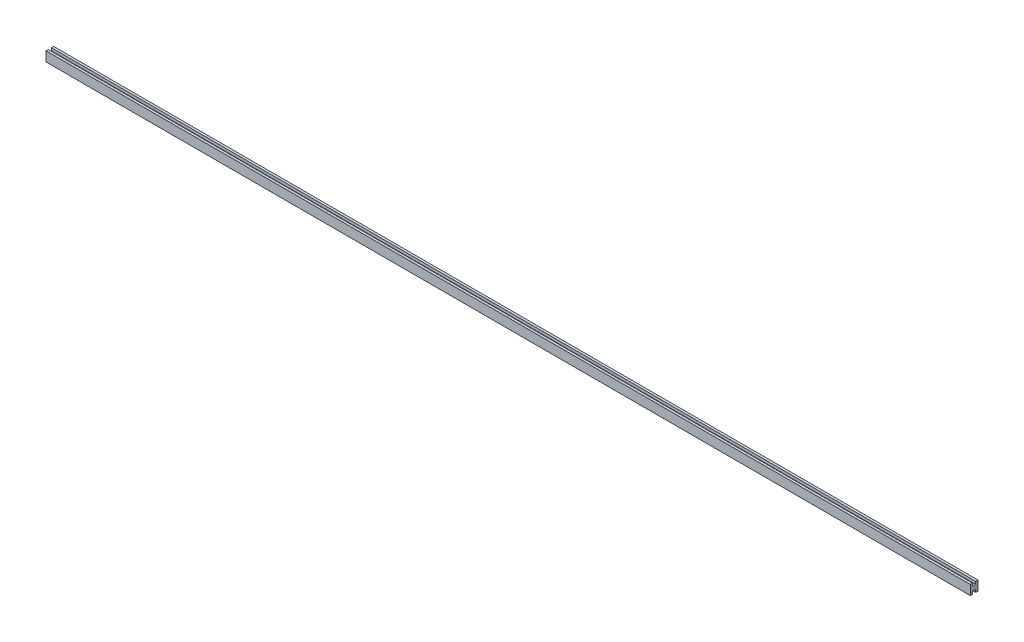
ISO-10303-21;
HEADER;
FILE_DESCRIPTION(('STEP AP214'),'2;1');
FILE_NAME('part.step','',(''),(''),'','','');
FILE_SCHEMA(('AUTOMOTIVE_DESIGN { 1 0 10303 214 1 1 1 1 }'));
ENDSEC;
DATA;
#1=APPLICATION_CONTEXT('core data for automotive mechanical design processes');
#2=APPLICATION_PROTOCOL_DEFINITION('international standard','automotive_design',2000,#1);
#3=PRODUCT_CONTEXT('',#1,'mechanical');
#4=PRODUCT('Part','Part','',(#3));
#5=PRODUCT_RELATED_PRODUCT_CATEGORY('part','',(#4));
#6=PRODUCT_DEFINITION_FORMATION('','',#4);
#7=PRODUCT_DEFINITION_CONTEXT('part definition',#1,'design');
#8=PRODUCT_DEFINITION('design','',#6,#7);
#9=PRODUCT_DEFINITION_SHAPE('','',#8);
#10=(LENGTH_UNIT() NAMED_UNIT(*) SI_UNIT(.MILLI.,.METRE.));
#11=(NAMED_UNIT(*) PLANE_ANGLE_UNIT() SI_UNIT($,.RADIAN.));
#12=(NAMED_UNIT(*) SI_UNIT($,.STERADIAN.) SOLID_ANGLE_UNIT());
#13=UNCERTAINTY_MEASURE_WITH_UNIT(LENGTH_MEASURE(1.E-05),#10,'distance_accuracy_value','');
#14=(GEOMETRIC_REPRESENTATION_CONTEXT(3) GLOBAL_UNCERTAINTY_ASSIGNED_CONTEXT((#13)) GLOBAL_UNIT_ASSIGNED_CONTEXT((#10,
#11,#12)) REPRESENTATION_CONTEXT('',''));
#15=CARTESIAN_POINT('',(0.,0.,0.));
#16=DIRECTION('',(0.,0.,1.));
#17=DIRECTION('',(1.,0.,0.));
#18=AXIS2_PLACEMENT_3D('',#15,#16,#17);
#19=CARTESIAN_POINT('',(3048.,15.875,12.7));
#20=DIRECTION('',(0.,1.,0.));
#21=DIRECTION('',(0.,0.,1.));
#22=AXIS2_PLACEMENT_3D('',#19,#20,#21);
#23=PLANE('',#22);
#24=DIRECTION('',(0.,0.,-1.));
#25=VECTOR('',#24,1.);
#26=CARTESIAN_POINT('',(0.,15.875,12.7));
#27=LINE('',#26,#25);
#28=CARTESIAN_POINT('',(0.,15.875,12.7));
#29=VERTEX_POINT('',#28);
#30=CARTESIAN_POINT('',(0.,15.875,5.08));
#31=VERTEX_POINT('',#30);
#32=EDGE_CURVE('E165',#29,#31,#27,.T.);
#33=ORIENTED_EDGE('',*,*,#32,.F.);
#34=DIRECTION('',(-1.,0.,0.));
#35=VECTOR('',#34,1.);
#36=CARTESIAN_POINT('',(3048.,15.875,12.7));
#37=LINE('',#36,#35);
#38=CARTESIAN_POINT('',(3048.,15.875,12.7));
#39=VERTEX_POINT('',#38);
#40=EDGE_CURVE('E11',#39,#29,#37,.T.);
#41=ORIENTED_EDGE('',*,*,#40,.F.);
#42=DIRECTION('',(0.,0.,-1.));
#43=VECTOR('',#42,1.);
#44=CARTESIAN_POINT('',(3048.,15.875,12.7));
#45=LINE('',#44,#43);
#46=CARTESIAN_POINT('',(3048.,15.875,5.08));
#47=VERTEX_POINT('',#46);
#48=EDGE_CURVE('E206',#39,#47,#45,.T.);
#49=ORIENTED_EDGE('',*,*,#48,.T.);
#50=DIRECTION('',(-1.,0.,0.));
#51=VECTOR('',#50,1.);
#52=CARTESIAN_POINT('',(3048.,15.875,5.08));
#53=LINE('',#52,#51);
#54=EDGE_CURVE('E42',#47,#31,#53,.T.);
#55=ORIENTED_EDGE('',*,*,#54,.T.);
#56=EDGE_LOOP('',(#33,#41,#49,#55));
#57=FACE_BOUND('',#56,.T.);
#58=ADVANCED_FACE('F39',(#57),#23,.T.);
#59=CARTESIAN_POINT('',(3048.,-15.875,12.7));
#60=DIRECTION('',(0.,0.,1.));
#61=DIRECTION('',(1.,0.,0.));
#62=AXIS2_PLACEMENT_3D('',#59,#60,#61);
#63=PLANE('',#62);
#64=DIRECTION('',(0.,1.,0.));
#65=VECTOR('',#64,1.);
#66=CARTESIAN_POINT('',(0.,-15.875,12.7));
#67=LINE('',#66,#65);
#68=CARTESIAN_POINT('',(0.,-15.875,12.7));
#69=VERTEX_POINT('',#68);
#70=EDGE_CURVE('E203',#69,#29,#67,.T.);
#71=ORIENTED_EDGE('',*,*,#70,.F.);
#72=DIRECTION('',(-1.,0.,0.));
#73=VECTOR('',#72,1.);
#74=CARTESIAN_POINT('',(3048.,-15.875,12.7));
#75=LINE('',#74,#73);
#76=CARTESIAN_POINT('',(3048.,-15.875,12.7));
#77=VERTEX_POINT('',#76);
#78=EDGE_CURVE('E49',#77,#69,#75,.T.);
#79=ORIENTED_EDGE('',*,*,#78,.F.);
#80=DIRECTION('',(0.,1.,0.));
#81=VECTOR('',#80,1.);
#82=CARTESIAN_POINT('',(3048.,-15.875,12.7));
#83=LINE('',#82,#81);
#84=EDGE_CURVE('E140',#77,#39,#83,.T.);
#85=ORIENTED_EDGE('',*,*,#84,.T.);
#86=ORIENTED_EDGE('',*,*,#40,.T.);
#87=EDGE_LOOP('',(#71,#79,#85,#86));
#88=FACE_BOUND('',#87,.T.);
#89=ADVANCED_FACE('F239',(#88),#63,.T.);
#90=CARTESIAN_POINT('',(3048.,-15.875,12.7));
#91=DIRECTION('',(0.,1.,0.));
#92=DIRECTION('',(0.,0.,1.));
#93=AXIS2_PLACEMENT_3D('',#90,#91,#92);
#94=PLANE('',#93);
#95=DIRECTION('',(0.,0.,-1.));
#96=VECTOR('',#95,1.);
#97=CARTESIAN_POINT('',(0.,-15.875,12.7));
#98=LINE('',#97,#96);
#99=CARTESIAN_POINT('',(0.,-15.875,5.08));
#100=VERTEX_POINT('',#99);
#101=EDGE_CURVE('E146',#69,#100,#98,.T.);
#102=ORIENTED_EDGE('',*,*,#101,.T.);
#103=DIRECTION('',(-1.,0.,0.));
#104=VECTOR('',#103,1.);
#105=CARTESIAN_POINT('',(3048.,-15.875,5.08));
#106=LINE('',#105,#104);
#107=CARTESIAN_POINT('',(3048.,-15.875,5.08));
#108=VERTEX_POINT('',#107);
#109=EDGE_CURVE('E144',#108,#100,#106,.T.);
#110=ORIENTED_EDGE('',*,*,#109,.F.);
#111=DIRECTION('',(0.,0.,-1.));
#112=VECTOR('',#111,1.);
#113=CARTESIAN_POINT('',(3048.,-15.875,12.7));
#114=LINE('',#113,#112);
#115=EDGE_CURVE('E134',#77,#108,#114,.T.);
#116=ORIENTED_EDGE('',*,*,#115,.F.);
#117=ORIENTED_EDGE('',*,*,#78,.T.);
#118=EDGE_LOOP('',(#102,#110,#116,#117));
#119=FACE_BOUND('',#118,.T.);
#120=ADVANCED_FACE('F145',(#119),#94,.F.);
#121=CARTESIAN_POINT('',(3048.,-15.875,5.08));
#122=DIRECTION('',(0.,0.,1.));
#123=DIRECTION('',(0.,-1.,0.));
#124=AXIS2_PLACEMENT_3D('',#121,#122,#123);
#125=PLANE('',#124);
#126=DIRECTION('',(0.,1.,0.));
#127=VECTOR('',#126,1.);
#128=CARTESIAN_POINT('',(0.,-15.875,5.08));
#129=LINE('',#128,#127);
#130=CARTESIAN_POINT('',(0.,-6.98499999999999,5.08));
#131=VERTEX_POINT('',#130);
#132=EDGE_CURVE('E198',#100,#131,#129,.T.);
#133=ORIENTED_EDGE('',*,*,#132,.T.);
#134=DIRECTION('',(-1.,0.,0.));
#135=VECTOR('',#134,1.);
#136=CARTESIAN_POINT('',(3048.,-6.98499999999999,5.08));
#137=LINE('',#136,#135);
#138=CARTESIAN_POINT('',(3048.,-6.98499999999999,5.08));
#139=VERTEX_POINT('',#138);
#140=EDGE_CURVE('E150',#139,#131,#137,.T.);
#141=ORIENTED_EDGE('',*,*,#140,.F.);
#142=DIRECTION('',(0.,1.,0.));
#143=VECTOR('',#142,1.);
#144=CARTESIAN_POINT('',(3048.,-15.875,5.08));
#145=LINE('',#144,#143);
#146=EDGE_CURVE('E138',#108,#139,#145,.T.);
#147=ORIENTED_EDGE('',*,*,#146,.F.);
#148=ORIENTED_EDGE('',*,*,#109,.T.);
#149=EDGE_LOOP('',(#133,#141,#147,#148));
#150=FACE_BOUND('',#149,.T.);
#151=ADVANCED_FACE('F152',(#150),#125,.F.);
#152=CARTESIAN_POINT('',(3048.,-6.98499999999999,5.08));
#153=DIRECTION('',(0.,1.,0.));
#154=DIRECTION('',(0.,0.,1.));
#155=AXIS2_PLACEMENT_3D('',#152,#153,#154);
#156=PLANE('',#155);
#157=DIRECTION('',(0.,0.,-1.));
#158=VECTOR('',#157,1.);
#159=CARTESIAN_POINT('',(0.,-6.98499999999999,5.08));
#160=LINE('',#159,#158);
#161=CARTESIAN_POINT('',(0.,-6.98499999999999,-5.08));
#162=VERTEX_POINT('',#161);
#163=EDGE_CURVE('E195',#131,#162,#160,.T.);
#164=ORIENTED_EDGE('',*,*,#163,.T.);
#165=DIRECTION('',(-1.,0.,0.));
#166=VECTOR('',#165,1.);
#167=CARTESIAN_POINT('',(3048.,-6.98499999999999,-5.08));
#168=LINE('',#167,#166);
#169=CARTESIAN_POINT('',(3048.,-6.98499999999999,-5.08));
#170=VERTEX_POINT('',#169);
#171=EDGE_CURVE('E212',#170,#162,#168,.T.);
#172=ORIENTED_EDGE('',*,*,#171,.F.);
#173=DIRECTION('',(0.,0.,-1.));
#174=VECTOR('',#173,1.);
#175=CARTESIAN_POINT('',(3048.,-6.98499999999999,5.08));
#176=LINE('',#175,#174);
#177=EDGE_CURVE('E156',#139,#170,#176,.T.);
#178=ORIENTED_EDGE('',*,*,#177,.F.);
#179=ORIENTED_EDGE('',*,*,#140,.T.);
#180=EDGE_LOOP('',(#164,#172,#178,#179));
#181=FACE_BOUND('',#180,.T.);
#182=ADVANCED_FACE('F252',(#181),#156,.F.);
#183=CARTESIAN_POINT('',(3048.,-6.98499999999999,-5.08));
#184=DIRECTION('',(0.,0.,-1.));
#185=DIRECTION('',(-1.,0.,0.));
#186=AXIS2_PLACEMENT_3D('',#183,#184,#185);
#187=PLANE('',#186);
#188=DIRECTION('',(0.,-1.,0.));
#189=VECTOR('',#188,1.);
#190=CARTESIAN_POINT('',(0.,-6.98499999999999,-5.08));
#191=LINE('',#190,#189);
#192=CARTESIAN_POINT('',(0.,-15.875,-5.08));
#193=VERTEX_POINT('',#192);
#194=EDGE_CURVE('E192',#162,#193,#191,.T.);
#195=ORIENTED_EDGE('',*,*,#194,.T.);
#196=DIRECTION('',(-1.,0.,0.));
#197=VECTOR('',#196,1.);
#198=CARTESIAN_POINT('',(3048.,-15.875,-5.08));
#199=LINE('',#198,#197);
#200=CARTESIAN_POINT('',(3048.,-15.875,-5.08));
#201=VERTEX_POINT('',#200);
#202=EDGE_CURVE('E216',#201,#193,#199,.T.);
#203=ORIENTED_EDGE('',*,*,#202,.F.);
#204=DIRECTION('',(0.,-1.,0.));
#205=VECTOR('',#204,1.);
#206=CARTESIAN_POINT('',(3048.,-6.98499999999999,-5.08));
#207=LINE('',#206,#205);
#208=EDGE_CURVE('E159',#170,#201,#207,.T.);
#209=ORIENTED_EDGE('',*,*,#208,.F.);
#210=ORIENTED_EDGE('',*,*,#171,.T.);
#211=EDGE_LOOP('',(#195,#203,#209,#210));
#212=FACE_BOUND('',#211,.T.);
#213=ADVANCED_FACE('F255',(#212),#187,.F.);
#214=CARTESIAN_POINT('',(3048.,-15.875,-5.08));
#215=DIRECTION('',(0.,1.,0.));
#216=DIRECTION('',(0.,0.,1.));
#217=AXIS2_PLACEMENT_3D('',#214,#215,#216);
#218=PLANE('',#217);
#219=DIRECTION('',(0.,0.,-1.));
#220=VECTOR('',#219,1.);
#221=CARTESIAN_POINT('',(0.,-15.875,-5.08));
#222=LINE('',#221,#220);
#223=CARTESIAN_POINT('',(0.,-15.875,-12.7));
#224=VERTEX_POINT('',#223);
#225=EDGE_CURVE('E189',#193,#224,#222,.T.);
#226=ORIENTED_EDGE('',*,*,#225,.T.);
#227=DIRECTION('',(-1.,0.,0.));
#228=VECTOR('',#227,1.);
#229=CARTESIAN_POINT('',(3048.,-15.875,-12.7));
#230=LINE('',#229,#228);
#231=CARTESIAN_POINT('',(3048.,-15.875,-12.7));
#232=VERTEX_POINT('',#231);
#233=EDGE_CURVE('E220',#232,#224,#230,.T.);
#234=ORIENTED_EDGE('',*,*,#233,.F.);
#235=DIRECTION('',(0.,0.,-1.));
#236=VECTOR('',#235,1.);
#237=CARTESIAN_POINT('',(3048.,-15.875,-5.08));
#238=LINE('',#237,#236);
#239=EDGE_CURVE('E383',#201,#232,#238,.T.);
#240=ORIENTED_EDGE('',*,*,#239,.F.);
#241=ORIENTED_EDGE('',*,*,#202,.T.);
#242=EDGE_LOOP('',(#226,#234,#240,#241));
#243=FACE_BOUND('',#242,.T.);
#244=ADVANCED_FACE('F259',(#243),#218,.F.);
#245=CARTESIAN_POINT('',(3048.,-15.875,-12.7));
#246=DIRECTION('',(0.,0.,1.));
#247=DIRECTION('',(1.,0.,0.));
#248=AXIS2_PLACEMENT_3D('',#245,#246,#247);
#249=PLANE('',#248);
#250=DIRECTION('',(0.,1.,0.));
#251=VECTOR('',#250,1.);
#252=CARTESIAN_POINT('',(0.,-15.875,-12.7));
#253=LINE('',#252,#251);
#254=CARTESIAN_POINT('',(0.,15.875,-12.7));
#255=VERTEX_POINT('',#254);
#256=EDGE_CURVE('E185',#224,#255,#253,.T.);
#257=ORIENTED_EDGE('',*,*,#256,.T.);
#258=DIRECTION('',(-1.,0.,0.));
#259=VECTOR('',#258,1.);
#260=CARTESIAN_POINT('',(3048.,15.875,-12.7));
#261=LINE('',#260,#259);
#262=CARTESIAN_POINT('',(3048.,15.875,-12.7));
#263=VERTEX_POINT('',#262);
#264=EDGE_CURVE('E224',#263,#255,#261,.T.);
#265=ORIENTED_EDGE('',*,*,#264,.F.);
#266=DIRECTION('',(0.,1.,0.));
#267=VECTOR('',#266,1.);
#268=CARTESIAN_POINT('',(3048.,-15.875,-12.7));
#269=LINE('',#268,#267);
#270=EDGE_CURVE('E388',#232,#263,#269,.T.);
#271=ORIENTED_EDGE('',*,*,#270,.F.);
#272=ORIENTED_EDGE('',*,*,#233,.T.);
#273=EDGE_LOOP('',(#257,#265,#271,#272));
#274=FACE_BOUND('',#273,.T.);
#275=ADVANCED_FACE('F263',(#274),#249,.F.);
#276=CARTESIAN_POINT('',(3048.,15.875,-5.08));
#277=DIRECTION('',(0.,1.,0.));
#278=DIRECTION('',(0.,0.,1.));
#279=AXIS2_PLACEMENT_3D('',#276,#277,#278);
#280=PLANE('',#279);
#281=DIRECTION('',(0.,0.,-1.));
#282=VECTOR('',#281,1.);
#283=CARTESIAN_POINT('',(0.,15.875,-5.08));
#284=LINE('',#283,#282);
#285=CARTESIAN_POINT('',(0.,15.875,-5.08));
#286=VERTEX_POINT('',#285);
#287=EDGE_CURVE('E181',#286,#255,#284,.T.);
#288=ORIENTED_EDGE('',*,*,#287,.F.);
#289=DIRECTION('',(-1.,0.,0.));
#290=VECTOR('',#289,1.);
#291=CARTESIAN_POINT('',(3048.,15.875,-5.08));
#292=LINE('',#291,#290);
#293=CARTESIAN_POINT('',(3048.,15.875,-5.08));
#294=VERTEX_POINT('',#293);
#295=EDGE_CURVE('E227',#294,#286,#292,.T.);
#296=ORIENTED_EDGE('',*,*,#295,.F.);
#297=DIRECTION('',(0.,0.,-1.));
#298=VECTOR('',#297,1.);
#299=CARTESIAN_POINT('',(3048.,15.875,-5.08));
#300=LINE('',#299,#298);
#301=EDGE_CURVE('E375',#294,#263,#300,.T.);
#302=ORIENTED_EDGE('',*,*,#301,.T.);
#303=ORIENTED_EDGE('',*,*,#264,.T.);
#304=EDGE_LOOP('',(#288,#296,#302,#303));
#305=FACE_BOUND('',#304,.T.);
#306=ADVANCED_FACE('F267',(#305),#280,.T.);
#307=CARTESIAN_POINT('',(3048.,6.98499999999999,-5.08));
#308=DIRECTION('',(0.,0.,1.));
#309=DIRECTION('',(1.,0.,0.));
#310=AXIS2_PLACEMENT_3D('',#307,#308,#309);
#311=PLANE('',#310);
#312=DIRECTION('',(0.,1.,0.));
#313=VECTOR('',#312,1.);
#314=CARTESIAN_POINT('',(0.,6.98499999999999,-5.08));
#315=LINE('',#314,#313);
#316=CARTESIAN_POINT('',(0.,6.98499999999999,-5.08));
#317=VERTEX_POINT('',#316);
#318=EDGE_CURVE('E177',#317,#286,#315,.T.);
#319=ORIENTED_EDGE('',*,*,#318,.F.);
#320=DIRECTION('',(-1.,0.,0.));
#321=VECTOR('',#320,1.);
#322=CARTESIAN_POINT('',(3048.,6.98499999999999,-5.08));
#323=LINE('',#322,#321);
#324=CARTESIAN_POINT('',(3048.,6.98499999999999,-5.08));
#325=VERTEX_POINT('',#324);
#326=EDGE_CURVE('E230',#325,#317,#323,.T.);
#327=ORIENTED_EDGE('',*,*,#326,.F.);
#328=DIRECTION('',(0.,1.,0.));
#329=VECTOR('',#328,1.);
#330=CARTESIAN_POINT('',(3048.,6.98499999999999,-5.08));
#331=LINE('',#330,#329);
#332=EDGE_CURVE('E371',#325,#294,#331,.T.);
#333=ORIENTED_EDGE('',*,*,#332,.T.);
#334=ORIENTED_EDGE('',*,*,#295,.T.);
#335=EDGE_LOOP('',(#319,#327,#333,#334));
#336=FACE_BOUND('',#335,.T.);
#337=ADVANCED_FACE('F271',(#336),#311,.T.);
#338=CARTESIAN_POINT('',(3048.,6.98499999999999,5.08));
#339=DIRECTION('',(0.,1.,0.));
#340=DIRECTION('',(0.,0.,1.));
#341=AXIS2_PLACEMENT_3D('',#338,#339,#340);
#342=PLANE('',#341);
#343=DIRECTION('',(0.,0.,-1.));
#344=VECTOR('',#343,1.);
#345=CARTESIAN_POINT('',(0.,6.98499999999999,5.08));
#346=LINE('',#345,#344);
#347=CARTESIAN_POINT('',(0.,6.98499999999999,5.08));
#348=VERTEX_POINT('',#347);
#349=EDGE_CURVE('E173',#348,#317,#346,.T.);
#350=ORIENTED_EDGE('',*,*,#349,.F.);
#351=DIRECTION('',(-1.,0.,0.));
#352=VECTOR('',#351,1.);
#353=CARTESIAN_POINT('',(3048.,6.98499999999999,5.08));
#354=LINE('',#353,#352);
#355=CARTESIAN_POINT('',(3048.,6.98499999999999,5.08));
#356=VERTEX_POINT('',#355);
#357=EDGE_CURVE('E232',#356,#348,#354,.T.);
#358=ORIENTED_EDGE('',*,*,#357,.F.);
#359=DIRECTION('',(0.,0.,-1.));
#360=VECTOR('',#359,1.);
#361=CARTESIAN_POINT('',(3048.,6.98499999999999,5.08));
#362=LINE('',#361,#360);
#363=EDGE_CURVE('E397',#356,#325,#362,.T.);
#364=ORIENTED_EDGE('',*,*,#363,.T.);
#365=ORIENTED_EDGE('',*,*,#326,.T.);
#366=EDGE_LOOP('',(#350,#358,#364,#365));
#367=FACE_BOUND('',#366,.T.);
#368=ADVANCED_FACE('F275',(#367),#342,.T.);
#369=CARTESIAN_POINT('',(3048.,15.875,5.08));
#370=DIRECTION('',(0.,0.,-1.));
#371=DIRECTION('',(0.,1.,0.));
#372=AXIS2_PLACEMENT_3D('',#369,#370,#371);
#373=PLANE('',#372);
#374=DIRECTION('',(0.,-1.,0.));
#375=VECTOR('',#374,1.);
#376=CARTESIAN_POINT('',(0.,15.875,5.08));
#377=LINE('',#376,#375);
#378=EDGE_CURVE('E169',#31,#348,#377,.T.);
#379=ORIENTED_EDGE('',*,*,#378,.F.);
#380=ORIENTED_EDGE('',*,*,#54,.F.);
#381=DIRECTION('',(0.,-1.,0.));
#382=VECTOR('',#381,1.);
#383=CARTESIAN_POINT('',(3048.,15.875,5.08));
#384=LINE('',#383,#382);
#385=EDGE_CURVE('E400',#47,#356,#384,.T.);
#386=ORIENTED_EDGE('',*,*,#385,.T.);
#387=ORIENTED_EDGE('',*,*,#357,.T.);
#388=EDGE_LOOP('',(#379,#380,#386,#387));
#389=FACE_BOUND('',#388,.T.);
#390=ADVANCED_FACE('F236',(#389),#373,.T.);
#391=CARTESIAN_POINT('',(3048.,0.,0.));
#392=DIRECTION('',(-1.,0.,0.));
#393=DIRECTION('',(0.,0.,1.));
#394=AXIS2_PLACEMENT_3D('',#391,#392,#393);
#395=PLANE('',#394);
#396=ORIENTED_EDGE('',*,*,#48,.F.);
#397=ORIENTED_EDGE('',*,*,#84,.F.);
#398=ORIENTED_EDGE('',*,*,#115,.T.);
#399=ORIENTED_EDGE('',*,*,#146,.T.);
#400=ORIENTED_EDGE('',*,*,#177,.T.);
#401=ORIENTED_EDGE('',*,*,#208,.T.);
#402=ORIENTED_EDGE('',*,*,#239,.T.);
#403=ORIENTED_EDGE('',*,*,#270,.T.);
#404=ORIENTED_EDGE('',*,*,#301,.F.);
#405=ORIENTED_EDGE('',*,*,#332,.F.);
#406=ORIENTED_EDGE('',*,*,#363,.F.);
#407=ORIENTED_EDGE('',*,*,#385,.F.);
#408=EDGE_LOOP('',(#396,#397,#398,#399,#400,#401,#402,#403,#404,#405,#406,#407));
#409=FACE_BOUND('',#408,.T.);
#410=ADVANCED_FACE('F136',(#409),#395,.F.);
#411=CARTESIAN_POINT('',(0.,0.,0.));
#412=DIRECTION('',(-1.,0.,0.));
#413=DIRECTION('',(0.,0.,1.));
#414=AXIS2_PLACEMENT_3D('',#411,#412,#413);
#415=PLANE('',#414);
#416=ORIENTED_EDGE('',*,*,#32,.T.);
#417=ORIENTED_EDGE('',*,*,#378,.T.);
#418=ORIENTED_EDGE('',*,*,#349,.T.);
#419=ORIENTED_EDGE('',*,*,#318,.T.);
#420=ORIENTED_EDGE('',*,*,#287,.T.);
#421=ORIENTED_EDGE('',*,*,#256,.F.);
#422=ORIENTED_EDGE('',*,*,#225,.F.);
#423=ORIENTED_EDGE('',*,*,#194,.F.);
#424=ORIENTED_EDGE('',*,*,#163,.F.);
#425=ORIENTED_EDGE('',*,*,#132,.F.);
#426=ORIENTED_EDGE('',*,*,#101,.F.);
#427=ORIENTED_EDGE('',*,*,#70,.T.);
#428=EDGE_LOOP('',(#416,#417,#418,#419,#420,#421,#422,#423,#424,#425,#426,#427));
#429=FACE_BOUND('',#428,.T.);
#430=ADVANCED_FACE('F238',(#429),#415,.T.);
#431=CLOSED_SHELL('',(#58,#89,#120,#151,#182,#213,#244,#275,#306,#337,#368,#390,#410,#430));
#432=MANIFOLD_SOLID_BREP('B2',#431);
#433=ADVANCED_BREP_SHAPE_REPRESENTATION('',(#18,#432),#14);
#434=SHAPE_DEFINITION_REPRESENTATION(#9,#433);
ENDSEC;
END-ISO-10303-21;
